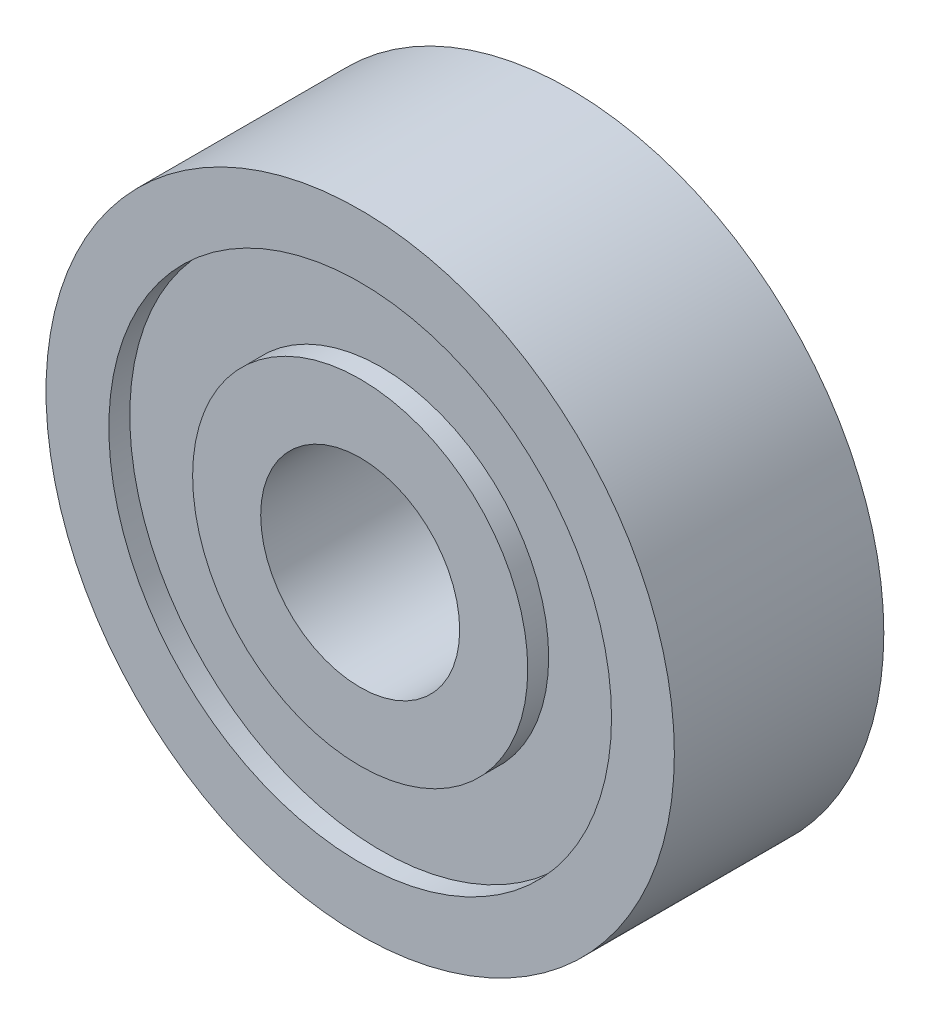
ISO-10303-21;
HEADER;
FILE_DESCRIPTION(('STEP AP214'),'2;1');
FILE_NAME('part.step','',(''),(''),'','','');
FILE_SCHEMA(('AUTOMOTIVE_DESIGN { 1 0 10303 214 1 1 1 1 }'));
ENDSEC;
DATA;
#1=APPLICATION_CONTEXT('core data for automotive mechanical design processes');
#2=APPLICATION_PROTOCOL_DEFINITION('international standard','automotive_design',2000,#1);
#3=PRODUCT_CONTEXT('',#1,'mechanical');
#4=PRODUCT('Part','Part','',(#3));
#5=PRODUCT_RELATED_PRODUCT_CATEGORY('part','',(#4));
#6=PRODUCT_DEFINITION_FORMATION('','',#4);
#7=PRODUCT_DEFINITION_CONTEXT('part definition',#1,'design');
#8=PRODUCT_DEFINITION('design','',#6,#7);
#9=PRODUCT_DEFINITION_SHAPE('','',#8);
#10=(LENGTH_UNIT() NAMED_UNIT(*) SI_UNIT(.MILLI.,.METRE.));
#11=(NAMED_UNIT(*) PLANE_ANGLE_UNIT() SI_UNIT($,.RADIAN.));
#12=(NAMED_UNIT(*) SI_UNIT($,.STERADIAN.) SOLID_ANGLE_UNIT());
#13=UNCERTAINTY_MEASURE_WITH_UNIT(LENGTH_MEASURE(1.E-05),#10,'distance_accuracy_value','');
#14=(GEOMETRIC_REPRESENTATION_CONTEXT(3) GLOBAL_UNCERTAINTY_ASSIGNED_CONTEXT((#13)) GLOBAL_UNIT_ASSIGNED_CONTEXT((#10,
#11,#12)) REPRESENTATION_CONTEXT('',''));
#15=CARTESIAN_POINT('',(0.,0.,0.));
#16=DIRECTION('',(0.,0.,1.));
#17=DIRECTION('',(1.,0.,0.));
#18=AXIS2_PLACEMENT_3D('',#15,#16,#17);
#19=CARTESIAN_POINT('',(0.,0.,10.));
#20=DIRECTION('',(0.,0.,1.));
#21=DIRECTION('',(1.,0.,0.));
#22=AXIS2_PLACEMENT_3D('',#19,#20,#21);
#23=PLANE('',#22);
#24=CARTESIAN_POINT('',(0.,0.,10.));
#25=DIRECTION('',(0.,0.,1.));
#26=DIRECTION('',(1.,0.,0.));
#27=AXIS2_PLACEMENT_3D('',#24,#25,#26);
#28=CIRCLE('',#27,4.75);
#29=CARTESIAN_POINT('',(4.75,0.,10.));
#30=VERTEX_POINT('',#29);
#31=EDGE_CURVE('E51',#30,#30,#28,.T.);
#32=ORIENTED_EDGE('',*,*,#31,.F.);
#33=EDGE_LOOP('',(#32));
#34=FACE_BOUND('',#33,.T.);
#35=CARTESIAN_POINT('',(0.,0.,10.));
#36=DIRECTION('',(0.,0.,1.));
#37=DIRECTION('',(1.,0.,0.));
#38=AXIS2_PLACEMENT_3D('',#35,#36,#37);
#39=CIRCLE('',#38,8.);
#40=CARTESIAN_POINT('',(8.,0.,10.));
#41=VERTEX_POINT('',#40);
#42=EDGE_CURVE('E85',#41,#41,#39,.T.);
#43=ORIENTED_EDGE('',*,*,#42,.T.);
#44=EDGE_LOOP('',(#43));
#45=FACE_BOUND('',#44,.T.);
#46=ADVANCED_FACE('F38',(#34,#45),#23,.T.);
#47=CARTESIAN_POINT('',(0.,0.,0.));
#48=DIRECTION('',(0.,0.,1.));
#49=DIRECTION('',(1.,0.,0.));
#50=AXIS2_PLACEMENT_3D('',#47,#48,#49);
#51=PLANE('',#50);
#52=CARTESIAN_POINT('',(0.,0.,0.));
#53=DIRECTION('',(0.,0.,1.));
#54=DIRECTION('',(1.,0.,0.));
#55=AXIS2_PLACEMENT_3D('',#52,#53,#54);
#56=CIRCLE('',#55,4.75);
#57=CARTESIAN_POINT('',(4.75,0.,0.));
#58=VERTEX_POINT('',#57);
#59=EDGE_CURVE('E53',#58,#58,#56,.T.);
#60=ORIENTED_EDGE('',*,*,#59,.T.);
#61=EDGE_LOOP('',(#60));
#62=FACE_BOUND('',#61,.T.);
#63=CARTESIAN_POINT('',(0.,0.,0.));
#64=DIRECTION('',(0.,0.,1.));
#65=DIRECTION('',(1.,0.,0.));
#66=AXIS2_PLACEMENT_3D('',#63,#64,#65);
#67=CIRCLE('',#66,8.);
#68=CARTESIAN_POINT('',(8.,0.,0.));
#69=VERTEX_POINT('',#68);
#70=EDGE_CURVE('E69',#69,#69,#67,.T.);
#71=ORIENTED_EDGE('',*,*,#70,.F.);
#72=EDGE_LOOP('',(#71));
#73=FACE_BOUND('',#72,.T.);
#74=ADVANCED_FACE('F112',(#62,#73),#51,.F.);
#75=CARTESIAN_POINT('',(0.,0.,10.));
#76=DIRECTION('',(0.,0.,1.));
#77=DIRECTION('',(1.,0.,0.));
#78=AXIS2_PLACEMENT_3D('',#75,#76,#77);
#79=CIRCLE('',#78,12.);
#80=CARTESIAN_POINT('',(12.,0.,10.));
#81=VERTEX_POINT('',#80);
#82=EDGE_CURVE('E77',#81,#81,#79,.T.);
#83=ORIENTED_EDGE('',*,*,#82,.F.);
#84=EDGE_LOOP('',(#83));
#85=FACE_BOUND('',#84,.T.);
#86=CARTESIAN_POINT('',(0.,0.,10.));
#87=DIRECTION('',(0.,0.,1.));
#88=DIRECTION('',(1.,0.,0.));
#89=AXIS2_PLACEMENT_3D('',#86,#87,#88);
#90=CIRCLE('',#89,15.);
#91=CARTESIAN_POINT('',(15.,0.,10.));
#92=VERTEX_POINT('',#91);
#93=EDGE_CURVE('E10',#92,#92,#90,.T.);
#94=ORIENTED_EDGE('',*,*,#93,.T.);
#95=EDGE_LOOP('',(#94));
#96=FACE_BOUND('',#95,.T.);
#97=ADVANCED_FACE('F109',(#85,#96),#23,.T.);
#98=CARTESIAN_POINT('',(0.,0.,0.));
#99=DIRECTION('',(0.,0.,1.));
#100=DIRECTION('',(1.,0.,0.));
#101=AXIS2_PLACEMENT_3D('',#98,#99,#100);
#102=CIRCLE('',#101,12.);
#103=CARTESIAN_POINT('',(12.,0.,0.));
#104=VERTEX_POINT('',#103);
#105=EDGE_CURVE('E61',#104,#104,#102,.T.);
#106=ORIENTED_EDGE('',*,*,#105,.T.);
#107=EDGE_LOOP('',(#106));
#108=FACE_BOUND('',#107,.T.);
#109=CARTESIAN_POINT('',(0.,0.,0.));
#110=DIRECTION('',(0.,0.,1.));
#111=DIRECTION('',(1.,0.,0.));
#112=AXIS2_PLACEMENT_3D('',#109,#110,#111);
#113=CIRCLE('',#112,15.);
#114=CARTESIAN_POINT('',(15.,0.,0.));
#115=VERTEX_POINT('',#114);
#116=EDGE_CURVE('E42',#115,#115,#113,.T.);
#117=ORIENTED_EDGE('',*,*,#116,.F.);
#118=EDGE_LOOP('',(#117));
#119=FACE_BOUND('',#118,.T.);
#120=ADVANCED_FACE('F111',(#108,#119),#51,.F.);
#121=CARTESIAN_POINT('',(0.,0.,10.));
#122=DIRECTION('',(0.,0.,-1.));
#123=DIRECTION('',(-1.,0.,0.));
#124=AXIS2_PLACEMENT_3D('',#121,#122,#123);
#125=CYLINDRICAL_SURFACE('',#124,15.);
#126=ORIENTED_EDGE('',*,*,#93,.F.);
#127=EDGE_LOOP('',(#126));
#128=FACE_BOUND('',#127,.T.);
#129=ORIENTED_EDGE('',*,*,#116,.T.);
#130=EDGE_LOOP('',(#129));
#131=FACE_BOUND('',#130,.T.);
#132=ADVANCED_FACE('F40',(#128,#131),#125,.T.);
#133=CARTESIAN_POINT('',(0.,0.,10.));
#134=DIRECTION('',(0.,0.,-1.));
#135=DIRECTION('',(-1.,0.,0.));
#136=AXIS2_PLACEMENT_3D('',#133,#134,#135);
#137=CYLINDRICAL_SURFACE('',#136,4.75);
#138=ORIENTED_EDGE('',*,*,#31,.T.);
#139=EDGE_LOOP('',(#138));
#140=FACE_BOUND('',#139,.T.);
#141=ORIENTED_EDGE('',*,*,#59,.F.);
#142=EDGE_LOOP('',(#141));
#143=FACE_BOUND('',#142,.T.);
#144=ADVANCED_FACE('F142',(#140,#143),#137,.F.);
#145=CARTESIAN_POINT('',(0.,0.,0.999999999999997));
#146=DIRECTION('',(0.,0.,1.));
#147=DIRECTION('',(1.,0.,0.));
#148=AXIS2_PLACEMENT_3D('',#145,#146,#147);
#149=PLANE('',#148);
#150=CARTESIAN_POINT('',(0.,0.,0.999999999999997));
#151=DIRECTION('',(0.,0.,1.));
#152=DIRECTION('',(1.,0.,0.));
#153=AXIS2_PLACEMENT_3D('',#150,#151,#152);
#154=CIRCLE('',#153,12.);
#155=CARTESIAN_POINT('',(12.,0.,0.999999999999997));
#156=VERTEX_POINT('',#155);
#157=EDGE_CURVE('E57',#156,#156,#154,.T.);
#158=ORIENTED_EDGE('',*,*,#157,.F.);
#159=EDGE_LOOP('',(#158));
#160=FACE_BOUND('',#159,.T.);
#161=CARTESIAN_POINT('',(0.,0.,0.999999999999997));
#162=DIRECTION('',(0.,0.,1.));
#163=DIRECTION('',(1.,0.,0.));
#164=AXIS2_PLACEMENT_3D('',#161,#162,#163);
#165=CIRCLE('',#164,8.);
#166=CARTESIAN_POINT('',(8.,0.,0.999999999999997));
#167=VERTEX_POINT('',#166);
#168=EDGE_CURVE('E65',#167,#167,#165,.T.);
#169=ORIENTED_EDGE('',*,*,#168,.T.);
#170=EDGE_LOOP('',(#169));
#171=FACE_BOUND('',#170,.T.);
#172=ADVANCED_FACE('F139',(#160,#171),#149,.F.);
#173=CARTESIAN_POINT('',(0.,0.,0.999999999999997));
#174=DIRECTION('',(0.,0.,-1.));
#175=DIRECTION('',(-1.,0.,0.));
#176=AXIS2_PLACEMENT_3D('',#173,#174,#175);
#177=CYLINDRICAL_SURFACE('',#176,12.);
#178=ORIENTED_EDGE('',*,*,#157,.T.);
#179=EDGE_LOOP('',(#178));
#180=FACE_BOUND('',#179,.T.);
#181=ORIENTED_EDGE('',*,*,#105,.F.);
#182=EDGE_LOOP('',(#181));
#183=FACE_BOUND('',#182,.T.);
#184=ADVANCED_FACE('F137',(#180,#183),#177,.F.);
#185=CARTESIAN_POINT('',(0.,0.,0.999999999999997));
#186=DIRECTION('',(0.,0.,-1.));
#187=DIRECTION('',(-1.,0.,0.));
#188=AXIS2_PLACEMENT_3D('',#185,#186,#187);
#189=CYLINDRICAL_SURFACE('',#188,8.);
#190=ORIENTED_EDGE('',*,*,#168,.F.);
#191=EDGE_LOOP('',(#190));
#192=FACE_BOUND('',#191,.T.);
#193=ORIENTED_EDGE('',*,*,#70,.T.);
#194=EDGE_LOOP('',(#193));
#195=FACE_BOUND('',#194,.T.);
#196=ADVANCED_FACE('F105',(#192,#195),#189,.T.);
#197=CARTESIAN_POINT('',(0.,0.,9.00000000000001));
#198=DIRECTION('',(0.,0.,1.));
#199=DIRECTION('',(1.,0.,0.));
#200=AXIS2_PLACEMENT_3D('',#197,#198,#199);
#201=CYLINDRICAL_SURFACE('',#200,12.);
#202=CARTESIAN_POINT('',(0.,0.,9.00000000000001));
#203=DIRECTION('',(0.,0.,1.));
#204=DIRECTION('',(1.,0.,0.));
#205=AXIS2_PLACEMENT_3D('',#202,#203,#204);
#206=CIRCLE('',#205,12.);
#207=CARTESIAN_POINT('',(12.,0.,9.00000000000001));
#208=VERTEX_POINT('',#207);
#209=EDGE_CURVE('E73',#208,#208,#206,.T.);
#210=ORIENTED_EDGE('',*,*,#209,.F.);
#211=EDGE_LOOP('',(#210));
#212=FACE_BOUND('',#211,.T.);
#213=ORIENTED_EDGE('',*,*,#82,.T.);
#214=EDGE_LOOP('',(#213));
#215=FACE_BOUND('',#214,.T.);
#216=ADVANCED_FACE('F99',(#212,#215),#201,.F.);
#217=CARTESIAN_POINT('',(0.,0.,9.00000000000001));
#218=DIRECTION('',(0.,0.,1.));
#219=DIRECTION('',(1.,0.,0.));
#220=AXIS2_PLACEMENT_3D('',#217,#218,#219);
#221=PLANE('',#220);
#222=CARTESIAN_POINT('',(0.,0.,9.00000000000001));
#223=DIRECTION('',(0.,0.,1.));
#224=DIRECTION('',(1.,0.,0.));
#225=AXIS2_PLACEMENT_3D('',#222,#223,#224);
#226=CIRCLE('',#225,8.);
#227=CARTESIAN_POINT('',(8.,0.,9.00000000000001));
#228=VERTEX_POINT('',#227);
#229=EDGE_CURVE('E81',#228,#228,#226,.T.);
#230=ORIENTED_EDGE('',*,*,#229,.F.);
#231=EDGE_LOOP('',(#230));
#232=FACE_BOUND('',#231,.T.);
#233=ORIENTED_EDGE('',*,*,#209,.T.);
#234=EDGE_LOOP('',(#233));
#235=FACE_BOUND('',#234,.T.);
#236=ADVANCED_FACE('F96',(#232,#235),#221,.T.);
#237=CARTESIAN_POINT('',(0.,0.,9.00000000000001));
#238=DIRECTION('',(0.,0.,1.));
#239=DIRECTION('',(1.,0.,0.));
#240=AXIS2_PLACEMENT_3D('',#237,#238,#239);
#241=CYLINDRICAL_SURFACE('',#240,8.);
#242=ORIENTED_EDGE('',*,*,#229,.T.);
#243=EDGE_LOOP('',(#242));
#244=FACE_BOUND('',#243,.T.);
#245=ORIENTED_EDGE('',*,*,#42,.F.);
#246=EDGE_LOOP('',(#245));
#247=FACE_BOUND('',#246,.T.);
#248=ADVANCED_FACE('F93',(#244,#247),#241,.T.);
#249=CLOSED_SHELL('',(#46,#74,#97,#120,#132,#144,#172,#184,#196,#216,#236,#248));
#250=MANIFOLD_SOLID_BREP('B2',#249);
#251=ADVANCED_BREP_SHAPE_REPRESENTATION('',(#18,#250),#14);
#252=SHAPE_DEFINITION_REPRESENTATION(#9,#251);
ENDSEC;
END-ISO-10303-21;
